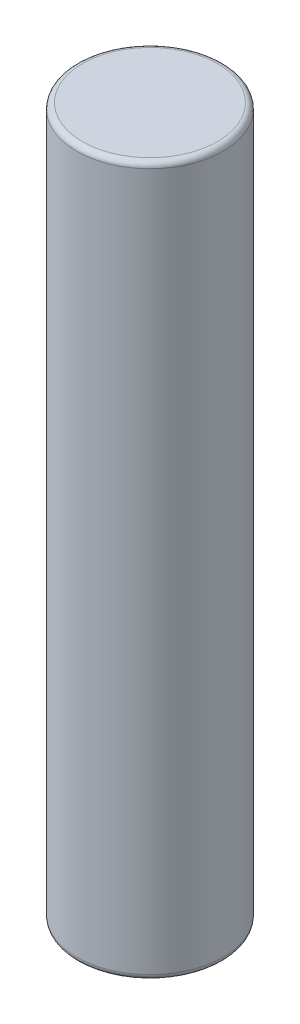
ISO-10303-21;
HEADER;
FILE_DESCRIPTION(('STEP AP214'),'2;1');
FILE_NAME('part.step','',(''),(''),'','','');
FILE_SCHEMA(('AUTOMOTIVE_DESIGN { 1 0 10303 214 1 1 1 1 }'));
ENDSEC;
DATA;
#1=APPLICATION_CONTEXT('core data for automotive mechanical design processes');
#2=APPLICATION_PROTOCOL_DEFINITION('international standard','automotive_design',2000,#1);
#3=PRODUCT_CONTEXT('',#1,'mechanical');
#4=PRODUCT('Part','Part','',(#3));
#5=PRODUCT_RELATED_PRODUCT_CATEGORY('part','',(#4));
#6=PRODUCT_DEFINITION_FORMATION('','',#4);
#7=PRODUCT_DEFINITION_CONTEXT('part definition',#1,'design');
#8=PRODUCT_DEFINITION('design','',#6,#7);
#9=PRODUCT_DEFINITION_SHAPE('','',#8);
#10=(LENGTH_UNIT() NAMED_UNIT(*) SI_UNIT(.MILLI.,.METRE.));
#11=(NAMED_UNIT(*) PLANE_ANGLE_UNIT() SI_UNIT($,.RADIAN.));
#12=(NAMED_UNIT(*) SI_UNIT($,.STERADIAN.) SOLID_ANGLE_UNIT());
#13=UNCERTAINTY_MEASURE_WITH_UNIT(LENGTH_MEASURE(1.E-05),#10,'distance_accuracy_value','');
#14=(GEOMETRIC_REPRESENTATION_CONTEXT(3) GLOBAL_UNCERTAINTY_ASSIGNED_CONTEXT((#13)) GLOBAL_UNIT_ASSIGNED_CONTEXT((#10,
#11,#12)) REPRESENTATION_CONTEXT('',''));
#15=CARTESIAN_POINT('',(0.,0.,0.));
#16=DIRECTION('',(0.,0.,1.));
#17=DIRECTION('',(1.,0.,0.));
#18=AXIS2_PLACEMENT_3D('',#15,#16,#17);
#19=CARTESIAN_POINT('',(0.,63.,0.));
#20=DIRECTION('',(0.,-1.,0.));
#21=DIRECTION('',(0.,0.,-1.));
#22=AXIS2_PLACEMENT_3D('',#19,#20,#21);
#23=CYLINDRICAL_SURFACE('',#22,6.5);
#24=CARTESIAN_POINT('',(0.,0.5,0.));
#25=DIRECTION('',(0.,1.,0.));
#26=DIRECTION('',(0.,0.,1.));
#27=AXIS2_PLACEMENT_3D('',#24,#25,#26);
#28=CIRCLE('',#27,6.5);
#29=CARTESIAN_POINT('',(0.,0.5,6.5));
#30=VERTEX_POINT('',#29);
#31=EDGE_CURVE('E50',#30,#30,#28,.T.);
#32=ORIENTED_EDGE('',*,*,#31,.T.);
#33=EDGE_LOOP('',(#32));
#34=FACE_BOUND('',#33,.T.);
#35=CARTESIAN_POINT('',(0.,62.5,0.));
#36=DIRECTION('',(0.,1.,0.));
#37=DIRECTION('',(0.,0.,1.));
#38=AXIS2_PLACEMENT_3D('',#35,#36,#37);
#39=CIRCLE('',#38,6.5);
#40=CARTESIAN_POINT('',(0.,62.5,6.5));
#41=VERTEX_POINT('',#40);
#42=EDGE_CURVE('E55',#41,#41,#39,.F.);
#43=ORIENTED_EDGE('',*,*,#42,.T.);
#44=EDGE_LOOP('',(#43));
#45=FACE_BOUND('',#44,.T.);
#46=ADVANCED_FACE('F37',(#34,#45),#23,.T.);
#47=CARTESIAN_POINT('',(0.,63.,0.));
#48=DIRECTION('',(0.,1.,0.));
#49=DIRECTION('',(0.,0.,1.));
#50=AXIS2_PLACEMENT_3D('',#47,#48,#49);
#51=PLANE('',#50);
#52=CARTESIAN_POINT('',(0.,63.,0.));
#53=DIRECTION('',(0.,1.,0.));
#54=DIRECTION('',(0.,0.,1.));
#55=AXIS2_PLACEMENT_3D('',#52,#53,#54);
#56=CIRCLE('',#55,6.);
#57=CARTESIAN_POINT('',(0.,63.,6.));
#58=VERTEX_POINT('',#57);
#59=EDGE_CURVE('E10',#58,#58,#56,.T.);
#60=ORIENTED_EDGE('',*,*,#59,.T.);
#61=EDGE_LOOP('',(#60));
#62=FACE_BOUND('',#61,.T.);
#63=ADVANCED_FACE('F72',(#62),#51,.T.);
#64=CARTESIAN_POINT('',(0.,0.,0.));
#65=DIRECTION('',(0.,1.,0.));
#66=DIRECTION('',(0.,0.,1.));
#67=AXIS2_PLACEMENT_3D('',#64,#65,#66);
#68=PLANE('',#67);
#69=CARTESIAN_POINT('',(0.,0.,0.));
#70=DIRECTION('',(0.,1.,0.));
#71=DIRECTION('',(0.,0.,1.));
#72=AXIS2_PLACEMENT_3D('',#69,#70,#71);
#73=CIRCLE('',#72,6.);
#74=CARTESIAN_POINT('',(0.,0.,6.));
#75=VERTEX_POINT('',#74);
#76=EDGE_CURVE('E45',#75,#75,#73,.F.);
#77=ORIENTED_EDGE('',*,*,#76,.T.);
#78=EDGE_LOOP('',(#77));
#79=FACE_BOUND('',#78,.T.);
#80=ADVANCED_FACE('F69',(#79),#68,.F.);
#81=CARTESIAN_POINT('',(0.,0.5,0.));
#82=DIRECTION('',(0.,1.,0.));
#83=DIRECTION('',(0.,0.,1.));
#84=AXIS2_PLACEMENT_3D('',#81,#82,#83);
#85=TOROIDAL_SURFACE('',#84,6.,0.5);
#86=ORIENTED_EDGE('',*,*,#76,.F.);
#87=EDGE_LOOP('',(#86));
#88=FACE_BOUND('',#87,.T.);
#89=ORIENTED_EDGE('',*,*,#31,.F.);
#90=EDGE_LOOP('',(#89));
#91=FACE_BOUND('',#90,.T.);
#92=ADVANCED_FACE('F65',(#88,#91),#85,.T.);
#93=CARTESIAN_POINT('',(0.,62.5,0.));
#94=DIRECTION('',(0.,1.,0.));
#95=DIRECTION('',(0.,0.,1.));
#96=AXIS2_PLACEMENT_3D('',#93,#94,#95);
#97=TOROIDAL_SURFACE('',#96,6.,0.5);
#98=ORIENTED_EDGE('',*,*,#42,.F.);
#99=EDGE_LOOP('',(#98));
#100=FACE_BOUND('',#99,.T.);
#101=ORIENTED_EDGE('',*,*,#59,.F.);
#102=EDGE_LOOP('',(#101));
#103=FACE_BOUND('',#102,.T.);
#104=ADVANCED_FACE('F39',(#100,#103),#97,.T.);
#105=CLOSED_SHELL('',(#46,#63,#80,#92,#104));
#106=MANIFOLD_SOLID_BREP('B2',#105);
#107=ADVANCED_BREP_SHAPE_REPRESENTATION('',(#18,#106),#14);
#108=SHAPE_DEFINITION_REPRESENTATION(#9,#107);
ENDSEC;
END-ISO-10303-21;
